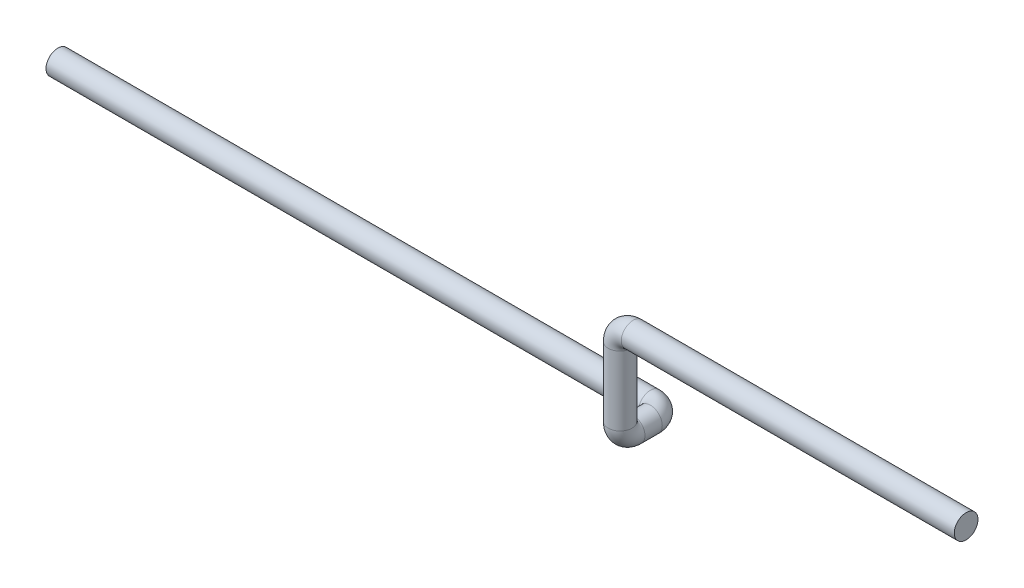
ISO-10303-21;
HEADER;
FILE_DESCRIPTION(('STEP AP214'),'2;1');
FILE_NAME('part.step','',(''),(''),'','','');
FILE_SCHEMA(('AUTOMOTIVE_DESIGN { 1 0 10303 214 1 1 1 1 }'));
ENDSEC;
DATA;
#1=APPLICATION_CONTEXT('core data for automotive mechanical design processes');
#2=APPLICATION_PROTOCOL_DEFINITION('international standard','automotive_design',2000,#1);
#3=PRODUCT_CONTEXT('',#1,'mechanical');
#4=PRODUCT('Part','Part','',(#3));
#5=PRODUCT_RELATED_PRODUCT_CATEGORY('part','',(#4));
#6=PRODUCT_DEFINITION_FORMATION('','',#4);
#7=PRODUCT_DEFINITION_CONTEXT('part definition',#1,'design');
#8=PRODUCT_DEFINITION('design','',#6,#7);
#9=PRODUCT_DEFINITION_SHAPE('','',#8);
#10=(LENGTH_UNIT() NAMED_UNIT(*) SI_UNIT(.MILLI.,.METRE.));
#11=(NAMED_UNIT(*) PLANE_ANGLE_UNIT() SI_UNIT($,.RADIAN.));
#12=(NAMED_UNIT(*) SI_UNIT($,.STERADIAN.) SOLID_ANGLE_UNIT());
#13=UNCERTAINTY_MEASURE_WITH_UNIT(LENGTH_MEASURE(1.E-05),#10,'distance_accuracy_value','');
#14=(GEOMETRIC_REPRESENTATION_CONTEXT(3) GLOBAL_UNCERTAINTY_ASSIGNED_CONTEXT((#13)) GLOBAL_UNIT_ASSIGNED_CONTEXT((#10,
#11,#12)) REPRESENTATION_CONTEXT('',''));
#15=CARTESIAN_POINT('',(0.,0.,0.));
#16=DIRECTION('',(0.,0.,1.));
#17=DIRECTION('',(1.,0.,0.));
#18=AXIS2_PLACEMENT_3D('',#15,#16,#17);
#19=CARTESIAN_POINT('',(0.,0.,0.));
#20=DIRECTION('',(1.,0.,0.));
#21=DIRECTION('',(0.,0.,-1.));
#22=AXIS2_PLACEMENT_3D('',#19,#20,#21);
#23=PLANE('',#22);
#24=CARTESIAN_POINT('',(0.,0.,0.));
#25=DIRECTION('',(1.,0.,0.));
#26=DIRECTION('',(0.,0.,-1.));
#27=AXIS2_PLACEMENT_3D('',#24,#25,#26);
#28=CIRCLE('',#27,13.7);
#29=CARTESIAN_POINT('',(0.,0.,-13.7));
#30=VERTEX_POINT('',#29);
#31=EDGE_CURVE('E47',#30,#30,#28,.T.);
#32=ORIENTED_EDGE('',*,*,#31,.T.);
#33=EDGE_LOOP('',(#32));
#34=FACE_BOUND('',#33,.T.);
#35=ADVANCED_FACE('F35',(#34),#23,.T.);
#36=CARTESIAN_POINT('',(-1100.,-110.,-50.));
#37=DIRECTION('',(1.,0.,0.));
#38=DIRECTION('',(0.,1.,0.));
#39=AXIS2_PLACEMENT_3D('',#36,#37,#38);
#40=PLANE('',#39);
#41=CARTESIAN_POINT('',(-1100.,-110.,-50.));
#42=DIRECTION('',(1.,0.,0.));
#43=DIRECTION('',(0.,1.,0.));
#44=AXIS2_PLACEMENT_3D('',#41,#42,#43);
#45=CIRCLE('',#44,13.7);
#46=CARTESIAN_POINT('',(-1100.,-96.3,-50.));
#47=VERTEX_POINT('',#46);
#48=EDGE_CURVE('E11',#47,#47,#45,.T.);
#49=ORIENTED_EDGE('',*,*,#48,.F.);
#50=EDGE_LOOP('',(#49));
#51=FACE_BOUND('',#50,.T.);
#52=ADVANCED_FACE('F53',(#51),#40,.F.);
#53=CARTESIAN_POINT('',(0.,0.,0.));
#54=DIRECTION('',(-1.,0.,0.));
#55=DIRECTION('',(0.,0.,1.));
#56=AXIS2_PLACEMENT_3D('',#53,#54,#55);
#57=CYLINDRICAL_SURFACE('',#56,13.7);
#58=CARTESIAN_POINT('',(-385.,0.,0.));
#59=DIRECTION('',(1.,0.,0.));
#60=DIRECTION('',(0.,0.,-1.));
#61=AXIS2_PLACEMENT_3D('',#58,#59,#60);
#62=CIRCLE('',#61,13.7);
#63=CARTESIAN_POINT('',(-385.,13.7,0.));
#64=VERTEX_POINT('',#63);
#65=EDGE_CURVE('E95',#64,#64,#62,.T.);
#66=ORIENTED_EDGE('',*,*,#65,.T.);
#67=EDGE_LOOP('',(#66));
#68=FACE_BOUND('',#67,.T.);
#69=ORIENTED_EDGE('',*,*,#31,.F.);
#70=EDGE_LOOP('',(#69));
#71=FACE_BOUND('',#70,.T.);
#72=ADVANCED_FACE('F55',(#68,#71),#57,.T.);
#73=CARTESIAN_POINT('',(-385.,-15.,0.));
#74=DIRECTION('',(0.,0.,1.));
#75=DIRECTION('',(1.,0.,0.));
#76=AXIS2_PLACEMENT_3D('',#73,#74,#75);
#77=TOROIDAL_SURFACE('',#76,15.,13.7);
#78=CARTESIAN_POINT('',(-400.,-15.,0.));
#79=DIRECTION('',(0.,1.,0.));
#80=DIRECTION('',(0.,0.,-1.));
#81=AXIS2_PLACEMENT_3D('',#78,#79,#80);
#82=CIRCLE('',#81,13.7);
#83=CARTESIAN_POINT('',(-413.7,-15.,0.));
#84=VERTEX_POINT('',#83);
#85=EDGE_CURVE('E92',#84,#84,#82,.T.);
#86=CARTESIAN_POINT('',(-385.,-15.,0.));
#87=DIRECTION('',(0.,0.,1.));
#88=DIRECTION('',(1.,0.,0.));
#89=AXIS2_PLACEMENT_3D('',#86,#87,#88);
#90=CIRCLE('',#89,28.7);
#91=EDGE_CURVE('',#64,#84,#90,.T.);
#92=ORIENTED_EDGE('',*,*,#65,.F.);
#93=ORIENTED_EDGE('',*,*,#85,.T.);
#94=ORIENTED_EDGE('',*,*,#91,.T.);
#95=ORIENTED_EDGE('',*,*,#91,.F.);
#96=EDGE_LOOP('',(#92,#94,#93,#95));
#97=FACE_BOUND('',#96,.T.);
#98=ADVANCED_FACE('F60',(#97),#77,.T.);
#99=CARTESIAN_POINT('',(-400.,-15.,0.));
#100=DIRECTION('',(0.,-1.,0.));
#101=DIRECTION('',(0.,0.,-1.));
#102=AXIS2_PLACEMENT_3D('',#99,#100,#101);
#103=CYLINDRICAL_SURFACE('',#102,13.7);
#104=CARTESIAN_POINT('',(-400.,-95.,0.));
#105=DIRECTION('',(0.,1.,0.));
#106=DIRECTION('',(0.,0.,-1.));
#107=AXIS2_PLACEMENT_3D('',#104,#105,#106);
#108=CIRCLE('',#107,13.7);
#109=CARTESIAN_POINT('',(-400.,-95.,13.7));
#110=VERTEX_POINT('',#109);
#111=EDGE_CURVE('E97',#110,#110,#108,.T.);
#112=ORIENTED_EDGE('',*,*,#111,.T.);
#113=EDGE_LOOP('',(#112));
#114=FACE_BOUND('',#113,.T.);
#115=ORIENTED_EDGE('',*,*,#85,.F.);
#116=EDGE_LOOP('',(#115));
#117=FACE_BOUND('',#116,.T.);
#118=ADVANCED_FACE('F80',(#114,#117),#103,.T.);
#119=CARTESIAN_POINT('',(-400.,-95.,-15.));
#120=DIRECTION('',(1.,0.,0.));
#121=DIRECTION('',(0.,0.,-1.));
#122=AXIS2_PLACEMENT_3D('',#119,#120,#121);
#123=TOROIDAL_SURFACE('',#122,15.,13.7);
#124=CARTESIAN_POINT('',(-400.,-110.,-15.));
#125=DIRECTION('',(0.,0.,1.));
#126=DIRECTION('',(0.,1.,0.));
#127=AXIS2_PLACEMENT_3D('',#124,#125,#126);
#128=CIRCLE('',#127,13.7);
#129=CARTESIAN_POINT('',(-400.,-123.7,-15.));
#130=VERTEX_POINT('',#129);
#131=EDGE_CURVE('E103',#130,#130,#128,.T.);
#132=CARTESIAN_POINT('',(-400.,-95.,-15.));
#133=DIRECTION('',(1.,0.,0.));
#134=DIRECTION('',(0.,0.,-1.));
#135=AXIS2_PLACEMENT_3D('',#132,#133,#134);
#136=CIRCLE('',#135,28.7);
#137=EDGE_CURVE('',#110,#130,#136,.T.);
#138=ORIENTED_EDGE('',*,*,#111,.F.);
#139=ORIENTED_EDGE('',*,*,#131,.T.);
#140=ORIENTED_EDGE('',*,*,#137,.T.);
#141=ORIENTED_EDGE('',*,*,#137,.F.);
#142=EDGE_LOOP('',(#138,#140,#139,#141));
#143=FACE_BOUND('',#142,.T.);
#144=ADVANCED_FACE('F76',(#143),#123,.T.);
#145=CARTESIAN_POINT('',(-400.,-110.,-15.));
#146=DIRECTION('',(0.,0.,-1.));
#147=DIRECTION('',(-1.,0.,0.));
#148=AXIS2_PLACEMENT_3D('',#145,#146,#147);
#149=CYLINDRICAL_SURFACE('',#148,13.7);
#150=CARTESIAN_POINT('',(-400.,-110.,-35.));
#151=DIRECTION('',(0.,0.,1.));
#152=DIRECTION('',(0.,1.,0.));
#153=AXIS2_PLACEMENT_3D('',#150,#151,#152);
#154=CIRCLE('',#153,13.7);
#155=CARTESIAN_POINT('',(-386.3,-110.,-35.));
#156=VERTEX_POINT('',#155);
#157=EDGE_CURVE('E106',#156,#156,#154,.T.);
#158=ORIENTED_EDGE('',*,*,#157,.T.);
#159=EDGE_LOOP('',(#158));
#160=FACE_BOUND('',#159,.T.);
#161=ORIENTED_EDGE('',*,*,#131,.F.);
#162=EDGE_LOOP('',(#161));
#163=FACE_BOUND('',#162,.T.);
#164=ADVANCED_FACE('F70',(#160,#163),#149,.T.);
#165=CARTESIAN_POINT('',(-415.,-110.,-35.));
#166=DIRECTION('',(0.,1.,0.));
#167=DIRECTION('',(0.,0.,1.));
#168=AXIS2_PLACEMENT_3D('',#165,#166,#167);
#169=TOROIDAL_SURFACE('',#168,15.,13.7);
#170=CARTESIAN_POINT('',(-415.,-110.,-50.));
#171=DIRECTION('',(1.,0.,0.));
#172=DIRECTION('',(0.,1.,0.));
#173=AXIS2_PLACEMENT_3D('',#170,#171,#172);
#174=CIRCLE('',#173,13.7);
#175=CARTESIAN_POINT('',(-415.,-110.,-63.7));
#176=VERTEX_POINT('',#175);
#177=EDGE_CURVE('E42',#176,#176,#174,.T.);
#178=CARTESIAN_POINT('',(-415.,-110.,-35.));
#179=DIRECTION('',(0.,1.,0.));
#180=DIRECTION('',(0.,0.,1.));
#181=AXIS2_PLACEMENT_3D('',#178,#179,#180);
#182=CIRCLE('',#181,28.7);
#183=EDGE_CURVE('',#156,#176,#182,.T.);
#184=ORIENTED_EDGE('',*,*,#157,.F.);
#185=ORIENTED_EDGE('',*,*,#177,.T.);
#186=ORIENTED_EDGE('',*,*,#183,.T.);
#187=ORIENTED_EDGE('',*,*,#183,.F.);
#188=EDGE_LOOP('',(#184,#186,#185,#187));
#189=FACE_BOUND('',#188,.T.);
#190=ADVANCED_FACE('F66',(#189),#169,.T.);
#191=CARTESIAN_POINT('',(-415.,-110.,-50.));
#192=DIRECTION('',(-1.,0.,0.));
#193=DIRECTION('',(0.,0.,1.));
#194=AXIS2_PLACEMENT_3D('',#191,#192,#193);
#195=CYLINDRICAL_SURFACE('',#194,13.7);
#196=ORIENTED_EDGE('',*,*,#48,.T.);
#197=EDGE_LOOP('',(#196));
#198=FACE_BOUND('',#197,.T.);
#199=ORIENTED_EDGE('',*,*,#177,.F.);
#200=EDGE_LOOP('',(#199));
#201=FACE_BOUND('',#200,.T.);
#202=ADVANCED_FACE('F50',(#198,#201),#195,.T.);
#203=CLOSED_SHELL('',(#35,#52,#72,#98,#118,#144,#164,#190,#202));
#204=MANIFOLD_SOLID_BREP('B2',#203);
#205=ADVANCED_BREP_SHAPE_REPRESENTATION('',(#18,#204),#14);
#206=SHAPE_DEFINITION_REPRESENTATION(#9,#205);
ENDSEC;
END-ISO-10303-21;
